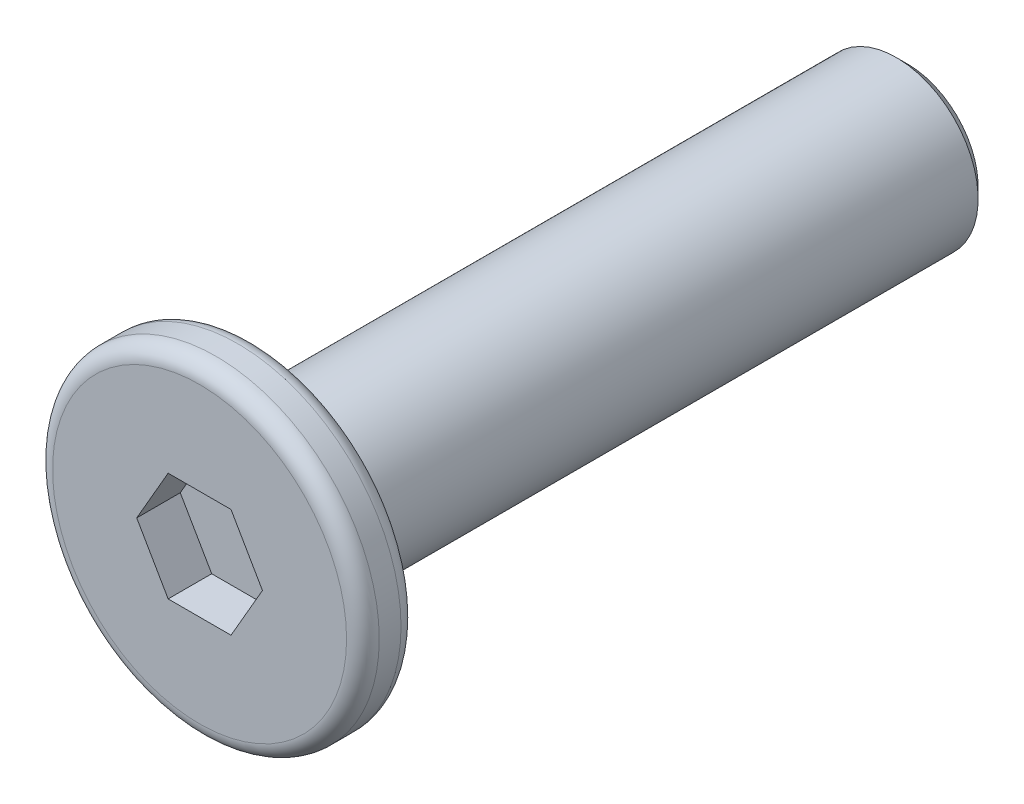
ISO-10303-21;
HEADER;
FILE_DESCRIPTION(('STEP AP214'),'2;1');
FILE_NAME('part.step','',(''),(''),'','','');
FILE_SCHEMA(('AUTOMOTIVE_DESIGN { 1 0 10303 214 1 1 1 1 }'));
ENDSEC;
DATA;
#1=APPLICATION_CONTEXT('core data for automotive mechanical design processes');
#2=APPLICATION_PROTOCOL_DEFINITION('international standard','automotive_design',2000,#1);
#3=PRODUCT_CONTEXT('',#1,'mechanical');
#4=PRODUCT('Part','Part','',(#3));
#5=PRODUCT_RELATED_PRODUCT_CATEGORY('part','',(#4));
#6=PRODUCT_DEFINITION_FORMATION('','',#4);
#7=PRODUCT_DEFINITION_CONTEXT('part definition',#1,'design');
#8=PRODUCT_DEFINITION('design','',#6,#7);
#9=PRODUCT_DEFINITION_SHAPE('','',#8);
#10=(LENGTH_UNIT() NAMED_UNIT(*) SI_UNIT(.MILLI.,.METRE.));
#11=(NAMED_UNIT(*) PLANE_ANGLE_UNIT() SI_UNIT($,.RADIAN.));
#12=(NAMED_UNIT(*) SI_UNIT($,.STERADIAN.) SOLID_ANGLE_UNIT());
#13=UNCERTAINTY_MEASURE_WITH_UNIT(LENGTH_MEASURE(1.E-05),#10,'distance_accuracy_value','');
#14=(GEOMETRIC_REPRESENTATION_CONTEXT(3) GLOBAL_UNCERTAINTY_ASSIGNED_CONTEXT((#13)) GLOBAL_UNIT_ASSIGNED_CONTEXT((#10,
#11,#12)) REPRESENTATION_CONTEXT('',''));
#15=CARTESIAN_POINT('',(0.,0.,0.));
#16=DIRECTION('',(0.,0.,1.));
#17=DIRECTION('',(1.,0.,0.));
#18=AXIS2_PLACEMENT_3D('',#15,#16,#17);
#19=CARTESIAN_POINT('',(0.,0.,0.5));
#20=DIRECTION('',(0.,0.,-1.));
#21=DIRECTION('',(-1.,0.,0.));
#22=AXIS2_PLACEMENT_3D('',#19,#20,#21);
#23=CYLINDRICAL_SURFACE('',#22,3.);
#24=CARTESIAN_POINT('',(0.,0.,-0.2));
#25=DIRECTION('',(0.,0.,1.));
#26=DIRECTION('',(1.,0.,0.));
#27=AXIS2_PLACEMENT_3D('',#24,#25,#26);
#28=CIRCLE('',#27,3.);
#29=CARTESIAN_POINT('',(3.,0.,-0.2));
#30=VERTEX_POINT('',#29);
#31=EDGE_CURVE('E154',#30,#30,#28,.T.);
#32=ORIENTED_EDGE('',*,*,#31,.T.);
#33=EDGE_LOOP('',(#32));
#34=FACE_BOUND('',#33,.T.);
#35=CARTESIAN_POINT('',(0.,0.,0.2));
#36=DIRECTION('',(0.,0.,1.));
#37=DIRECTION('',(1.,0.,0.));
#38=AXIS2_PLACEMENT_3D('',#35,#36,#37);
#39=CIRCLE('',#38,3.);
#40=CARTESIAN_POINT('',(3.,0.,0.2));
#41=VERTEX_POINT('',#40);
#42=EDGE_CURVE('E151',#41,#41,#39,.F.);
#43=ORIENTED_EDGE('',*,*,#42,.T.);
#44=EDGE_LOOP('',(#43));
#45=FACE_BOUND('',#44,.T.);
#46=ADVANCED_FACE('F35',(#34,#45),#23,.T.);
#47=CARTESIAN_POINT('',(0.,0.,0.5));
#48=DIRECTION('',(0.,0.,1.));
#49=DIRECTION('',(1.,0.,0.));
#50=AXIS2_PLACEMENT_3D('',#47,#48,#49);
#51=PLANE('',#50);
#52=CARTESIAN_POINT('',(0.,0.,0.5));
#53=DIRECTION('',(0.,0.,1.));
#54=DIRECTION('',(1.,0.,0.));
#55=AXIS2_PLACEMENT_3D('',#52,#53,#54);
#56=CIRCLE('',#55,2.7);
#57=CARTESIAN_POINT('',(2.7,0.,0.5));
#58=VERTEX_POINT('',#57);
#59=EDGE_CURVE('E11',#58,#58,#56,.T.);
#60=ORIENTED_EDGE('',*,*,#59,.T.);
#61=EDGE_LOOP('',(#60));
#62=FACE_BOUND('',#61,.T.);
#63=DIRECTION('',(0.5,0.866025403784439,0.));
#64=VECTOR('',#63,1.);
#65=CARTESIAN_POINT('',(0.577350269189626,-1.,0.5));
#66=LINE('',#65,#64);
#67=CARTESIAN_POINT('',(0.577350269189626,-1.,0.5));
#68=VERTEX_POINT('',#67);
#69=CARTESIAN_POINT('',(1.15470053837925,0.,0.5));
#70=VERTEX_POINT('',#69);
#71=EDGE_CURVE('E50',#68,#70,#66,.T.);
#72=ORIENTED_EDGE('',*,*,#71,.F.);
#73=DIRECTION('',(1.,0.,0.));
#74=VECTOR('',#73,1.);
#75=CARTESIAN_POINT('',(-0.577350269189625,-1.,0.5));
#76=LINE('',#75,#74);
#77=CARTESIAN_POINT('',(-0.577350269189625,-1.,0.5));
#78=VERTEX_POINT('',#77);
#79=EDGE_CURVE('E133',#78,#68,#76,.T.);
#80=ORIENTED_EDGE('',*,*,#79,.F.);
#81=DIRECTION('',(0.5,-0.866025403784438,0.));
#82=VECTOR('',#81,1.);
#83=CARTESIAN_POINT('',(-1.15470053837925,0.,0.5));
#84=LINE('',#83,#82);
#85=CARTESIAN_POINT('',(-1.15470053837925,0.,0.5));
#86=VERTEX_POINT('',#85);
#87=EDGE_CURVE('E131',#86,#78,#84,.T.);
#88=ORIENTED_EDGE('',*,*,#87,.F.);
#89=DIRECTION('',(-0.5,-0.866025403784438,0.));
#90=VECTOR('',#89,1.);
#91=CARTESIAN_POINT('',(-0.577350269189626,1.,0.5));
#92=LINE('',#91,#90);
#93=CARTESIAN_POINT('',(-0.577350269189626,1.,0.5));
#94=VERTEX_POINT('',#93);
#95=EDGE_CURVE('E98',#94,#86,#92,.T.);
#96=ORIENTED_EDGE('',*,*,#95,.F.);
#97=DIRECTION('',(-1.,0.,0.));
#98=VECTOR('',#97,1.);
#99=CARTESIAN_POINT('',(0.577350269189625,1.,0.5));
#100=LINE('',#99,#98);
#101=CARTESIAN_POINT('',(0.577350269189625,1.,0.5));
#102=VERTEX_POINT('',#101);
#103=EDGE_CURVE('E127',#102,#94,#100,.T.);
#104=ORIENTED_EDGE('',*,*,#103,.F.);
#105=DIRECTION('',(-0.5,0.866025403784438,0.));
#106=VECTOR('',#105,1.);
#107=CARTESIAN_POINT('',(1.15470053837925,0.,0.5));
#108=LINE('',#107,#106);
#109=EDGE_CURVE('E124',#70,#102,#108,.T.);
#110=ORIENTED_EDGE('',*,*,#109,.F.);
#111=EDGE_LOOP('',(#72,#80,#88,#96,#104,#110));
#112=FACE_BOUND('',#111,.T.);
#113=ADVANCED_FACE('F169',(#62,#112),#51,.T.);
#114=CARTESIAN_POINT('',(0.,0.,-0.5));
#115=DIRECTION('',(0.,0.,1.));
#116=DIRECTION('',(1.,0.,0.));
#117=AXIS2_PLACEMENT_3D('',#114,#115,#116);
#118=PLANE('',#117);
#119=CARTESIAN_POINT('',(0.,0.,-0.5));
#120=DIRECTION('',(0.,0.,1.));
#121=DIRECTION('',(1.,0.,0.));
#122=AXIS2_PLACEMENT_3D('',#119,#120,#121);
#123=CIRCLE('',#122,2.7);
#124=CARTESIAN_POINT('',(2.7,0.,-0.5));
#125=VERTEX_POINT('',#124);
#126=EDGE_CURVE('E43',#125,#125,#123,.F.);
#127=ORIENTED_EDGE('',*,*,#126,.T.);
#128=EDGE_LOOP('',(#127));
#129=FACE_BOUND('',#128,.T.);
#130=CARTESIAN_POINT('',(0.,0.,-0.5));
#131=DIRECTION('',(0.,0.,-1.));
#132=DIRECTION('',(-1.,0.,0.));
#133=AXIS2_PLACEMENT_3D('',#130,#131,#132);
#134=CIRCLE('',#133,1.5);
#135=CARTESIAN_POINT('',(-1.5,0.,-0.5));
#136=VERTEX_POINT('',#135);
#137=EDGE_CURVE('E137',#136,#136,#134,.T.);
#138=ORIENTED_EDGE('',*,*,#137,.F.);
#139=EDGE_LOOP('',(#138));
#140=FACE_BOUND('',#139,.T.);
#141=ADVANCED_FACE('F159',(#129,#140),#118,.F.);
#142=CARTESIAN_POINT('',(0.,0.,-12.5));
#143=DIRECTION('',(0.,0.,1.));
#144=DIRECTION('',(1.,0.,0.));
#145=AXIS2_PLACEMENT_3D('',#142,#143,#144);
#146=CYLINDRICAL_SURFACE('',#145,1.5);
#147=CARTESIAN_POINT('',(0.,0.,-12.3));
#148=DIRECTION('',(0.,0.,-1.));
#149=DIRECTION('',(-1.,0.,0.));
#150=AXIS2_PLACEMENT_3D('',#147,#148,#149);
#151=CIRCLE('',#150,1.5);
#152=CARTESIAN_POINT('',(-1.5,0.,-12.3));
#153=VERTEX_POINT('',#152);
#154=EDGE_CURVE('E148',#153,#153,#151,.F.);
#155=ORIENTED_EDGE('',*,*,#154,.T.);
#156=EDGE_LOOP('',(#155));
#157=FACE_BOUND('',#156,.T.);
#158=ORIENTED_EDGE('',*,*,#137,.T.);
#159=EDGE_LOOP('',(#158));
#160=FACE_BOUND('',#159,.T.);
#161=ADVANCED_FACE('F204',(#157,#160),#146,.T.);
#162=CARTESIAN_POINT('',(0.,0.,-12.5));
#163=DIRECTION('',(0.,0.,-1.));
#164=DIRECTION('',(-1.,0.,0.));
#165=AXIS2_PLACEMENT_3D('',#162,#163,#164);
#166=PLANE('',#165);
#167=CARTESIAN_POINT('',(0.,0.,-12.5));
#168=DIRECTION('',(0.,0.,-1.));
#169=DIRECTION('',(-1.,0.,0.));
#170=AXIS2_PLACEMENT_3D('',#167,#168,#169);
#171=CIRCLE('',#170,1.3);
#172=CARTESIAN_POINT('',(-1.3,0.,-12.5));
#173=VERTEX_POINT('',#172);
#174=EDGE_CURVE('E145',#173,#173,#171,.T.);
#175=ORIENTED_EDGE('',*,*,#174,.T.);
#176=EDGE_LOOP('',(#175));
#177=FACE_BOUND('',#176,.T.);
#178=ADVANCED_FACE('F196',(#177),#166,.T.);
#179=CARTESIAN_POINT('',(0.,0.,-12.5));
#180=DIRECTION('',(0.,0.,1.));
#181=DIRECTION('',(1.,0.,0.));
#182=AXIS2_PLACEMENT_3D('',#179,#180,#181);
#183=CONICAL_SURFACE('',#182,1.3,0.78539816339745);
#184=ORIENTED_EDGE('',*,*,#154,.F.);
#185=EDGE_LOOP('',(#184));
#186=FACE_BOUND('',#185,.T.);
#187=ORIENTED_EDGE('',*,*,#174,.F.);
#188=EDGE_LOOP('',(#187));
#189=FACE_BOUND('',#188,.T.);
#190=ADVANCED_FACE('F189',(#186,#189),#183,.T.);
#191=CARTESIAN_POINT('',(0.577350269189626,-1.,-0.3));
#192=DIRECTION('',(0.866025403784439,-0.5,0.));
#193=DIRECTION('',(0.5,0.866025403784439,0.));
#194=AXIS2_PLACEMENT_3D('',#191,#192,#193);
#195=PLANE('',#194);
#196=ORIENTED_EDGE('',*,*,#71,.T.);
#197=DIRECTION('',(0.,0.,1.));
#198=VECTOR('',#197,1.);
#199=CARTESIAN_POINT('',(1.15470053837925,0.,-0.3));
#200=LINE('',#199,#198);
#201=CARTESIAN_POINT('',(1.15470053837925,0.,-0.3));
#202=VERTEX_POINT('',#201);
#203=EDGE_CURVE('E80',#202,#70,#200,.T.);
#204=ORIENTED_EDGE('',*,*,#203,.F.);
#205=DIRECTION('',(0.5,0.866025403784439,0.));
#206=VECTOR('',#205,1.);
#207=CARTESIAN_POINT('',(0.577350269189626,-1.,-0.3));
#208=LINE('',#207,#206);
#209=CARTESIAN_POINT('',(0.577350269189626,-1.,-0.3));
#210=VERTEX_POINT('',#209);
#211=EDGE_CURVE('E135',#210,#202,#208,.T.);
#212=ORIENTED_EDGE('',*,*,#211,.F.);
#213=DIRECTION('',(0.,0.,1.));
#214=VECTOR('',#213,1.);
#215=CARTESIAN_POINT('',(0.577350269189626,-1.,-0.3));
#216=LINE('',#215,#214);
#217=EDGE_CURVE('E58',#210,#68,#216,.T.);
#218=ORIENTED_EDGE('',*,*,#217,.T.);
#219=EDGE_LOOP('',(#196,#204,#212,#218));
#220=FACE_BOUND('',#219,.T.);
#221=ADVANCED_FACE('F186',(#220),#195,.F.);
#222=CARTESIAN_POINT('',(-0.577350269189625,-1.,-0.3));
#223=DIRECTION('',(0.,-1.,0.));
#224=DIRECTION('',(1.,0.,0.));
#225=AXIS2_PLACEMENT_3D('',#222,#223,#224);
#226=PLANE('',#225);
#227=ORIENTED_EDGE('',*,*,#79,.T.);
#228=ORIENTED_EDGE('',*,*,#217,.F.);
#229=DIRECTION('',(1.,0.,0.));
#230=VECTOR('',#229,1.);
#231=CARTESIAN_POINT('',(-0.577350269189625,-1.,-0.3));
#232=LINE('',#231,#230);
#233=CARTESIAN_POINT('',(-0.577350269189625,-1.,-0.3));
#234=VERTEX_POINT('',#233);
#235=EDGE_CURVE('E110',#234,#210,#232,.T.);
#236=ORIENTED_EDGE('',*,*,#235,.F.);
#237=DIRECTION('',(0.,0.,1.));
#238=VECTOR('',#237,1.);
#239=CARTESIAN_POINT('',(-0.577350269189625,-1.,-0.3));
#240=LINE('',#239,#238);
#241=EDGE_CURVE('E102',#234,#78,#240,.T.);
#242=ORIENTED_EDGE('',*,*,#241,.T.);
#243=EDGE_LOOP('',(#227,#228,#236,#242));
#244=FACE_BOUND('',#243,.T.);
#245=ADVANCED_FACE('F188',(#244),#226,.F.);
#246=CARTESIAN_POINT('',(-1.15470053837925,0.,-0.3));
#247=DIRECTION('',(-0.866025403784438,-0.5,0.));
#248=DIRECTION('',(0.5,-0.866025403784438,0.));
#249=AXIS2_PLACEMENT_3D('',#246,#247,#248);
#250=PLANE('',#249);
#251=ORIENTED_EDGE('',*,*,#87,.T.);
#252=ORIENTED_EDGE('',*,*,#241,.F.);
#253=DIRECTION('',(0.5,-0.866025403784438,0.));
#254=VECTOR('',#253,1.);
#255=CARTESIAN_POINT('',(-1.15470053837925,0.,-0.3));
#256=LINE('',#255,#254);
#257=CARTESIAN_POINT('',(-1.15470053837925,0.,-0.3));
#258=VERTEX_POINT('',#257);
#259=EDGE_CURVE('E106',#258,#234,#256,.T.);
#260=ORIENTED_EDGE('',*,*,#259,.F.);
#261=DIRECTION('',(0.,0.,1.));
#262=VECTOR('',#261,1.);
#263=CARTESIAN_POINT('',(-1.15470053837925,0.,-0.3));
#264=LINE('',#263,#262);
#265=EDGE_CURVE('E91',#258,#86,#264,.T.);
#266=ORIENTED_EDGE('',*,*,#265,.T.);
#267=EDGE_LOOP('',(#251,#252,#260,#266));
#268=FACE_BOUND('',#267,.T.);
#269=ADVANCED_FACE('F107',(#268),#250,.F.);
#270=CARTESIAN_POINT('',(-0.577350269189626,1.,-0.3));
#271=DIRECTION('',(-0.866025403784438,0.5,0.));
#272=DIRECTION('',(-0.5,-0.866025403784439,0.));
#273=AXIS2_PLACEMENT_3D('',#270,#271,#272);
#274=PLANE('',#273);
#275=ORIENTED_EDGE('',*,*,#95,.T.);
#276=ORIENTED_EDGE('',*,*,#265,.F.);
#277=DIRECTION('',(-0.5,-0.866025403784438,0.));
#278=VECTOR('',#277,1.);
#279=CARTESIAN_POINT('',(-0.577350269189626,1.,-0.3));
#280=LINE('',#279,#278);
#281=CARTESIAN_POINT('',(-0.577350269189626,1.,-0.3));
#282=VERTEX_POINT('',#281);
#283=EDGE_CURVE('E95',#282,#258,#280,.T.);
#284=ORIENTED_EDGE('',*,*,#283,.F.);
#285=DIRECTION('',(0.,0.,1.));
#286=VECTOR('',#285,1.);
#287=CARTESIAN_POINT('',(-0.577350269189626,1.,-0.3));
#288=LINE('',#287,#286);
#289=EDGE_CURVE('E103',#282,#94,#288,.T.);
#290=ORIENTED_EDGE('',*,*,#289,.T.);
#291=EDGE_LOOP('',(#275,#276,#284,#290));
#292=FACE_BOUND('',#291,.T.);
#293=ADVANCED_FACE('F93',(#292),#274,.F.);
#294=CARTESIAN_POINT('',(0.577350269189625,1.,-0.3));
#295=DIRECTION('',(0.,1.,0.));
#296=DIRECTION('',(0.,0.,1.));
#297=AXIS2_PLACEMENT_3D('',#294,#295,#296);
#298=PLANE('',#297);
#299=ORIENTED_EDGE('',*,*,#103,.T.);
#300=ORIENTED_EDGE('',*,*,#289,.F.);
#301=DIRECTION('',(-1.,0.,0.));
#302=VECTOR('',#301,1.);
#303=CARTESIAN_POINT('',(0.577350269189625,1.,-0.3));
#304=LINE('',#303,#302);
#305=CARTESIAN_POINT('',(0.577350269189625,1.,-0.3));
#306=VERTEX_POINT('',#305);
#307=EDGE_CURVE('E116',#306,#282,#304,.T.);
#308=ORIENTED_EDGE('',*,*,#307,.F.);
#309=DIRECTION('',(0.,0.,1.));
#310=VECTOR('',#309,1.);
#311=CARTESIAN_POINT('',(0.577350269189625,1.,-0.3));
#312=LINE('',#311,#310);
#313=EDGE_CURVE('E140',#306,#102,#312,.T.);
#314=ORIENTED_EDGE('',*,*,#313,.T.);
#315=EDGE_LOOP('',(#299,#300,#308,#314));
#316=FACE_BOUND('',#315,.T.);
#317=ADVANCED_FACE('F257',(#316),#298,.F.);
#318=CARTESIAN_POINT('',(1.15470053837925,0.,-0.3));
#319=DIRECTION('',(0.866025403784438,0.5,0.));
#320=DIRECTION('',(-0.5,0.866025403784439,0.));
#321=AXIS2_PLACEMENT_3D('',#318,#319,#320);
#322=PLANE('',#321);
#323=ORIENTED_EDGE('',*,*,#109,.T.);
#324=ORIENTED_EDGE('',*,*,#313,.F.);
#325=DIRECTION('',(-0.5,0.866025403784438,0.));
#326=VECTOR('',#325,1.);
#327=CARTESIAN_POINT('',(1.15470053837925,0.,-0.3));
#328=LINE('',#327,#326);
#329=EDGE_CURVE('E118',#202,#306,#328,.T.);
#330=ORIENTED_EDGE('',*,*,#329,.F.);
#331=ORIENTED_EDGE('',*,*,#203,.T.);
#332=EDGE_LOOP('',(#323,#324,#330,#331));
#333=FACE_BOUND('',#332,.T.);
#334=ADVANCED_FACE('F184',(#333),#322,.F.);
#335=CARTESIAN_POINT('',(0.,0.,-0.3));
#336=DIRECTION('',(0.,0.,1.));
#337=DIRECTION('',(1.,0.,0.));
#338=AXIS2_PLACEMENT_3D('',#335,#336,#337);
#339=PLANE('',#338);
#340=ORIENTED_EDGE('',*,*,#211,.T.);
#341=ORIENTED_EDGE('',*,*,#329,.T.);
#342=ORIENTED_EDGE('',*,*,#307,.T.);
#343=ORIENTED_EDGE('',*,*,#283,.T.);
#344=ORIENTED_EDGE('',*,*,#259,.T.);
#345=ORIENTED_EDGE('',*,*,#235,.T.);
#346=EDGE_LOOP('',(#340,#341,#342,#343,#344,#345));
#347=FACE_BOUND('',#346,.T.);
#348=ADVANCED_FACE('F113',(#347),#339,.T.);
#349=CARTESIAN_POINT('',(0.,0.,-0.2));
#350=DIRECTION('',(0.,0.,1.));
#351=DIRECTION('',(1.,0.,0.));
#352=AXIS2_PLACEMENT_3D('',#349,#350,#351);
#353=TOROIDAL_SURFACE('',#352,2.7,0.3);
#354=ORIENTED_EDGE('',*,*,#126,.F.);
#355=EDGE_LOOP('',(#354));
#356=FACE_BOUND('',#355,.T.);
#357=ORIENTED_EDGE('',*,*,#31,.F.);
#358=EDGE_LOOP('',(#357));
#359=FACE_BOUND('',#358,.T.);
#360=ADVANCED_FACE('F162',(#356,#359),#353,.T.);
#361=CARTESIAN_POINT('',(0.,0.,0.2));
#362=DIRECTION('',(0.,0.,1.));
#363=DIRECTION('',(1.,0.,0.));
#364=AXIS2_PLACEMENT_3D('',#361,#362,#363);
#365=TOROIDAL_SURFACE('',#364,2.7,0.3);
#366=ORIENTED_EDGE('',*,*,#42,.F.);
#367=EDGE_LOOP('',(#366));
#368=FACE_BOUND('',#367,.T.);
#369=ORIENTED_EDGE('',*,*,#59,.F.);
#370=EDGE_LOOP('',(#369));
#371=FACE_BOUND('',#370,.T.);
#372=ADVANCED_FACE('F37',(#368,#371),#365,.T.);
#373=CLOSED_SHELL('',(#46,#113,#141,#161,#178,#190,#221,#245,#269,#293,#317,#334,#348,#360,#372));
#374=MANIFOLD_SOLID_BREP('B2',#373);
#375=ADVANCED_BREP_SHAPE_REPRESENTATION('',(#18,#374),#14);
#376=SHAPE_DEFINITION_REPRESENTATION(#9,#375);
ENDSEC;
END-ISO-10303-21;
